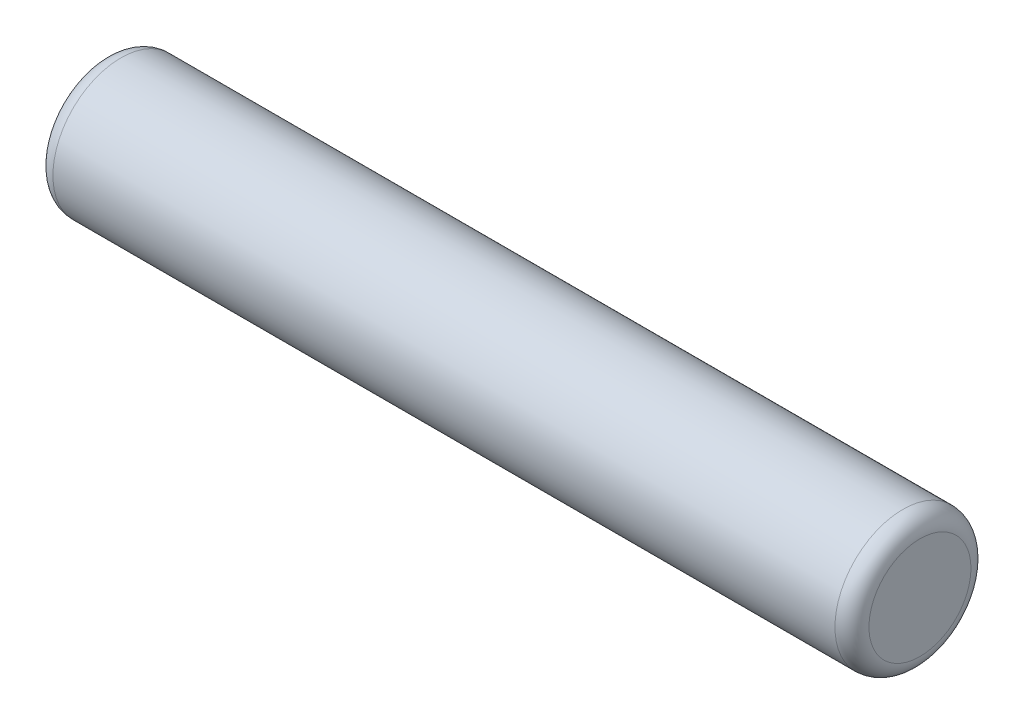
ISO-10303-21;
HEADER;
FILE_DESCRIPTION(('STEP AP214'),'2;1');
FILE_NAME('part.step','',(''),(''),'','','');
FILE_SCHEMA(('AUTOMOTIVE_DESIGN { 1 0 10303 214 1 1 1 1 }'));
ENDSEC;
DATA;
#1=APPLICATION_CONTEXT('core data for automotive mechanical design processes');
#2=APPLICATION_PROTOCOL_DEFINITION('international standard','automotive_design',2000,#1);
#3=PRODUCT_CONTEXT('',#1,'mechanical');
#4=PRODUCT('Part','Part','',(#3));
#5=PRODUCT_RELATED_PRODUCT_CATEGORY('part','',(#4));
#6=PRODUCT_DEFINITION_FORMATION('','',#4);
#7=PRODUCT_DEFINITION_CONTEXT('part definition',#1,'design');
#8=PRODUCT_DEFINITION('design','',#6,#7);
#9=PRODUCT_DEFINITION_SHAPE('','',#8);
#10=(LENGTH_UNIT() NAMED_UNIT(*) SI_UNIT(.MILLI.,.METRE.));
#11=(NAMED_UNIT(*) PLANE_ANGLE_UNIT() SI_UNIT($,.RADIAN.));
#12=(NAMED_UNIT(*) SI_UNIT($,.STERADIAN.) SOLID_ANGLE_UNIT());
#13=UNCERTAINTY_MEASURE_WITH_UNIT(LENGTH_MEASURE(1.E-05),#10,'distance_accuracy_value','');
#14=(GEOMETRIC_REPRESENTATION_CONTEXT(3) GLOBAL_UNCERTAINTY_ASSIGNED_CONTEXT((#13)) GLOBAL_UNIT_ASSIGNED_CONTEXT((#10,
#11,#12)) REPRESENTATION_CONTEXT('',''));
#15=CARTESIAN_POINT('',(0.,0.,0.));
#16=DIRECTION('',(0.,0.,1.));
#17=DIRECTION('',(1.,0.,0.));
#18=AXIS2_PLACEMENT_3D('',#15,#16,#17);
#19=CARTESIAN_POINT('',(12.,0.,0.));
#20=DIRECTION('',(1.,0.,0.));
#21=DIRECTION('',(0.,0.,-1.));
#22=AXIS2_PLACEMENT_3D('',#19,#20,#21);
#23=PLANE('',#22);
#24=CARTESIAN_POINT('',(12.,0.,0.));
#25=DIRECTION('',(1.,0.,0.));
#26=DIRECTION('',(0.,0.,-1.));
#27=AXIS2_PLACEMENT_3D('',#24,#25,#26);
#28=CIRCLE('',#27,1.50000000000012);
#29=CARTESIAN_POINT('',(12.,0.,-1.50000000000015));
#30=VERTEX_POINT('',#29);
#31=EDGE_CURVE('E10',#30,#30,#28,.T.);
#32=ORIENTED_EDGE('',*,*,#31,.T.);
#33=EDGE_LOOP('',(#32));
#34=FACE_BOUND('',#33,.T.);
#35=ADVANCED_FACE('F14',(#34),#23,.T.);
#36=CARTESIAN_POINT('',(11.5,0.,0.));
#37=DIRECTION('',(1.,0.,0.));
#38=DIRECTION('',(0.,1.,0.));
#39=AXIS2_PLACEMENT_3D('',#36,#37,#38);
#40=TOROIDAL_SURFACE('',#39,1.5,0.5);
#41=CARTESIAN_POINT('',(11.5,0.,0.));
#42=DIRECTION('',(1.,0.,0.));
#43=DIRECTION('',(0.,0.,-1.));
#44=AXIS2_PLACEMENT_3D('',#41,#42,#43);
#45=CIRCLE('',#44,2.);
#46=CARTESIAN_POINT('',(11.5,0.,-2.));
#47=VERTEX_POINT('',#46);
#48=EDGE_CURVE('E31',#47,#47,#45,.T.);
#49=ORIENTED_EDGE('',*,*,#48,.T.);
#50=EDGE_LOOP('',(#49));
#51=FACE_BOUND('',#50,.T.);
#52=ORIENTED_EDGE('',*,*,#31,.F.);
#53=EDGE_LOOP('',(#52));
#54=FACE_BOUND('',#53,.T.);
#55=ADVANCED_FACE('F51',(#51,#54),#40,.T.);
#56=CARTESIAN_POINT('',(-12.,0.,0.));
#57=DIRECTION('',(1.,0.,0.));
#58=DIRECTION('',(0.,0.,-1.));
#59=AXIS2_PLACEMENT_3D('',#56,#57,#58);
#60=PLANE('',#59);
#61=CARTESIAN_POINT('',(-12.,0.,0.));
#62=DIRECTION('',(1.,0.,0.));
#63=DIRECTION('',(0.,0.,-1.));
#64=AXIS2_PLACEMENT_3D('',#61,#62,#63);
#65=CIRCLE('',#64,1.50000000000015);
#66=CARTESIAN_POINT('',(-12.,0.,-1.50000000000007));
#67=VERTEX_POINT('',#66);
#68=EDGE_CURVE('E23',#67,#67,#65,.T.);
#69=ORIENTED_EDGE('',*,*,#68,.F.);
#70=EDGE_LOOP('',(#69));
#71=FACE_BOUND('',#70,.T.);
#72=ADVANCED_FACE('F48',(#71),#60,.F.);
#73=CARTESIAN_POINT('',(0.,0.,0.));
#74=DIRECTION('',(1.,0.,0.));
#75=DIRECTION('',(0.,0.,-1.));
#76=AXIS2_PLACEMENT_3D('',#73,#74,#75);
#77=CYLINDRICAL_SURFACE('',#76,2.);
#78=ORIENTED_EDGE('',*,*,#48,.F.);
#79=EDGE_LOOP('',(#78));
#80=FACE_BOUND('',#79,.T.);
#81=CARTESIAN_POINT('',(-11.5,0.,0.));
#82=DIRECTION('',(1.,0.,0.));
#83=DIRECTION('',(0.,0.,-1.));
#84=AXIS2_PLACEMENT_3D('',#81,#82,#83);
#85=CIRCLE('',#84,2.);
#86=CARTESIAN_POINT('',(-11.5,0.,-2.));
#87=VERTEX_POINT('',#86);
#88=EDGE_CURVE('E18',#87,#87,#85,.T.);
#89=ORIENTED_EDGE('',*,*,#88,.T.);
#90=EDGE_LOOP('',(#89));
#91=FACE_BOUND('',#90,.T.);
#92=ADVANCED_FACE('F40',(#80,#91),#77,.T.);
#93=CARTESIAN_POINT('',(-11.5,0.,2.99871238951255E-13));
#94=DIRECTION('',(1.,0.,0.));
#95=DIRECTION('',(0.,1.,-1.99766129564215E-13));
#96=AXIS2_PLACEMENT_3D('',#93,#94,#95);
#97=TOROIDAL_SURFACE('',#96,1.50000000000004,0.5);
#98=ORIENTED_EDGE('',*,*,#68,.T.);
#99=EDGE_LOOP('',(#98));
#100=FACE_BOUND('',#99,.T.);
#101=ORIENTED_EDGE('',*,*,#88,.F.);
#102=EDGE_LOOP('',(#101));
#103=FACE_BOUND('',#102,.T.);
#104=ADVANCED_FACE('F16',(#100,#103),#97,.T.);
#105=CLOSED_SHELL('',(#35,#55,#72,#92,#104));
#106=MANIFOLD_SOLID_BREP('B1',#105);
#107=ADVANCED_BREP_SHAPE_REPRESENTATION('',(#18,#106),#14);
#108=SHAPE_DEFINITION_REPRESENTATION(#9,#107);
ENDSEC;
END-ISO-10303-21;
